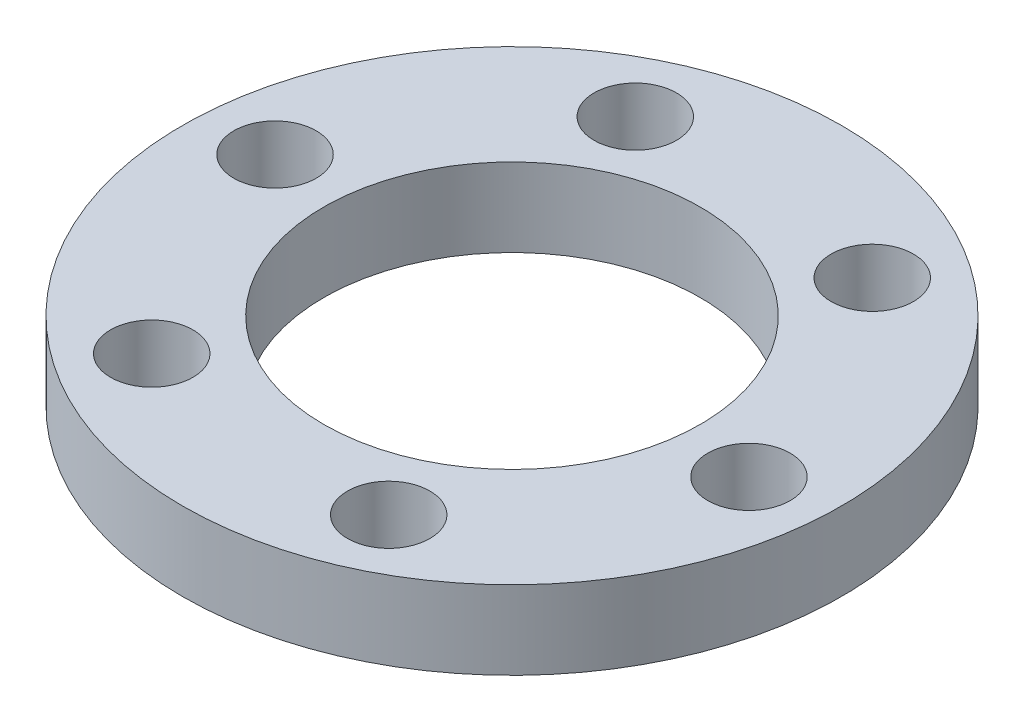
ISO-10303-21;
HEADER;
FILE_DESCRIPTION(('STEP AP214'),'2;1');
FILE_NAME('part.step','',(''),(''),'','','');
FILE_SCHEMA(('AUTOMOTIVE_DESIGN { 1 0 10303 214 1 1 1 1 }'));
ENDSEC;
DATA;
#1=APPLICATION_CONTEXT('core data for automotive mechanical design processes');
#2=APPLICATION_PROTOCOL_DEFINITION('international standard','automotive_design',2000,#1);
#3=PRODUCT_CONTEXT('',#1,'mechanical');
#4=PRODUCT('Part','Part','',(#3));
#5=PRODUCT_RELATED_PRODUCT_CATEGORY('part','',(#4));
#6=PRODUCT_DEFINITION_FORMATION('','',#4);
#7=PRODUCT_DEFINITION_CONTEXT('part definition',#1,'design');
#8=PRODUCT_DEFINITION('design','',#6,#7);
#9=PRODUCT_DEFINITION_SHAPE('','',#8);
#10=(LENGTH_UNIT() NAMED_UNIT(*) SI_UNIT(.MILLI.,.METRE.));
#11=(NAMED_UNIT(*) PLANE_ANGLE_UNIT() SI_UNIT($,.RADIAN.));
#12=(NAMED_UNIT(*) SI_UNIT($,.STERADIAN.) SOLID_ANGLE_UNIT());
#13=UNCERTAINTY_MEASURE_WITH_UNIT(LENGTH_MEASURE(1.E-05),#10,'distance_accuracy_value','');
#14=(GEOMETRIC_REPRESENTATION_CONTEXT(3) GLOBAL_UNCERTAINTY_ASSIGNED_CONTEXT((#13)) GLOBAL_UNIT_ASSIGNED_CONTEXT((#10,
#11,#12)) REPRESENTATION_CONTEXT('',''));
#15=CARTESIAN_POINT('',(0.,0.,0.));
#16=DIRECTION('',(0.,0.,1.));
#17=DIRECTION('',(1.,0.,0.));
#18=AXIS2_PLACEMENT_3D('',#15,#16,#17);
#19=CARTESIAN_POINT('',(0.,5.,0.));
#20=DIRECTION('',(0.,1.,0.));
#21=DIRECTION('',(0.,0.,1.));
#22=AXIS2_PLACEMENT_3D('',#19,#20,#21);
#23=PLANE('',#22);
#24=CARTESIAN_POINT('',(7.05789789959426,5.,14.9142910404376));
#25=DIRECTION('',(0.,1.,0.));
#26=DIRECTION('',(0.,0.,1.));
#27=AXIS2_PLACEMENT_3D('',#24,#25,#26);
#28=CIRCLE('',#27,2.62499999999985);
#29=CARTESIAN_POINT('',(7.05789789959426,5.,17.5392910404374));
#30=VERTEX_POINT('',#29);
#31=EDGE_CURVE('E88',#30,#30,#28,.T.);
#32=ORIENTED_EDGE('',*,*,#31,.F.);
#33=EDGE_LOOP('',(#32));
#34=FACE_BOUND('',#33,.T.);
#35=CARTESIAN_POINT('',(9.38720597065741,5.,-13.5694643985856));
#36=DIRECTION('',(0.,1.,0.));
#37=DIRECTION('',(0.,0.,1.));
#38=AXIS2_PLACEMENT_3D('',#35,#36,#37);
#39=CIRCLE('',#38,2.6250000000013);
#40=CARTESIAN_POINT('',(9.38720597065741,5.,-10.9444643985843));
#41=VERTEX_POINT('',#40);
#42=EDGE_CURVE('E72',#41,#41,#39,.T.);
#43=ORIENTED_EDGE('',*,*,#42,.F.);
#44=EDGE_LOOP('',(#43));
#45=FACE_BOUND('',#44,.T.);
#46=CARTESIAN_POINT('',(-16.4451038702514,5.,-1.34482664185481));
#47=DIRECTION('',(0.,1.,0.));
#48=DIRECTION('',(0.,0.,1.));
#49=AXIS2_PLACEMENT_3D('',#46,#47,#48);
#50=CIRCLE('',#49,2.625);
#51=CARTESIAN_POINT('',(-16.4451038702514,5.,1.28017335814519));
#52=VERTEX_POINT('',#51);
#53=EDGE_CURVE('E56',#52,#52,#50,.T.);
#54=ORIENTED_EDGE('',*,*,#53,.F.);
#55=EDGE_LOOP('',(#54));
#56=FACE_BOUND('',#55,.T.);
#57=CARTESIAN_POINT('',(0.,5.,0.));
#58=DIRECTION('',(0.,1.,0.));
#59=DIRECTION('',(0.,0.,1.));
#60=AXIS2_PLACEMENT_3D('',#57,#58,#59);
#61=CIRCLE('',#60,21.);
#62=CARTESIAN_POINT('',(0.,5.,21.));
#63=VERTEX_POINT('',#62);
#64=EDGE_CURVE('E10',#63,#63,#61,.T.);
#65=ORIENTED_EDGE('',*,*,#64,.T.);
#66=EDGE_LOOP('',(#65));
#67=FACE_BOUND('',#66,.T.);
#68=CARTESIAN_POINT('',(0.,5.,0.));
#69=DIRECTION('',(0.,1.,0.));
#70=DIRECTION('',(0.,0.,1.));
#71=AXIS2_PLACEMENT_3D('',#68,#69,#70);
#72=CIRCLE('',#71,12.);
#73=CARTESIAN_POINT('',(0.,5.,12.));
#74=VERTEX_POINT('',#73);
#75=EDGE_CURVE('E50',#74,#74,#72,.T.);
#76=ORIENTED_EDGE('',*,*,#75,.F.);
#77=EDGE_LOOP('',(#76));
#78=FACE_BOUND('',#77,.T.);
#79=CARTESIAN_POINT('',(-7.05789789959408,5.,-14.9142910404394));
#80=DIRECTION('',(0.,1.,0.));
#81=DIRECTION('',(0.,0.,1.));
#82=AXIS2_PLACEMENT_3D('',#79,#80,#81);
#83=CIRCLE('',#82,2.62500000000094);
#84=CARTESIAN_POINT('',(-7.05789789959408,5.,-12.2892910404385));
#85=VERTEX_POINT('',#84);
#86=EDGE_CURVE('E64',#85,#85,#83,.T.);
#87=ORIENTED_EDGE('',*,*,#86,.F.);
#88=EDGE_LOOP('',(#87));
#89=FACE_BOUND('',#88,.T.);
#90=CARTESIAN_POINT('',(16.4451038702516,5.,1.34482664185296));
#91=DIRECTION('',(0.,1.,0.));
#92=DIRECTION('',(0.,0.,1.));
#93=AXIS2_PLACEMENT_3D('',#90,#91,#92);
#94=CIRCLE('',#93,2.62500000000074);
#95=CARTESIAN_POINT('',(16.4451038702516,5.,3.9698266418537));
#96=VERTEX_POINT('',#95);
#97=EDGE_CURVE('E80',#96,#96,#94,.T.);
#98=ORIENTED_EDGE('',*,*,#97,.F.);
#99=EDGE_LOOP('',(#98));
#100=FACE_BOUND('',#99,.T.);
#101=CARTESIAN_POINT('',(-9.38720597065723,5.,13.5694643985837));
#102=DIRECTION('',(0.,1.,0.));
#103=DIRECTION('',(0.,0.,1.));
#104=AXIS2_PLACEMENT_3D('',#101,#102,#103);
#105=CIRCLE('',#104,2.62499999999951);
#106=CARTESIAN_POINT('',(-9.38720597065723,5.,16.1944643985832));
#107=VERTEX_POINT('',#106);
#108=EDGE_CURVE('E96',#107,#107,#105,.T.);
#109=ORIENTED_EDGE('',*,*,#108,.F.);
#110=EDGE_LOOP('',(#109));
#111=FACE_BOUND('',#110,.T.);
#112=ADVANCED_FACE('F37',(#34,#45,#56,#67,#78,#89,#100,#111),#23,.T.);
#113=CARTESIAN_POINT('',(0.,0.,0.));
#114=DIRECTION('',(0.,1.,0.));
#115=DIRECTION('',(0.,0.,1.));
#116=AXIS2_PLACEMENT_3D('',#113,#114,#115);
#117=PLANE('',#116);
#118=CARTESIAN_POINT('',(0.,0.,0.));
#119=DIRECTION('',(0.,1.,0.));
#120=DIRECTION('',(0.,0.,1.));
#121=AXIS2_PLACEMENT_3D('',#118,#119,#120);
#122=CIRCLE('',#121,21.);
#123=CARTESIAN_POINT('',(0.,0.,21.));
#124=VERTEX_POINT('',#123);
#125=EDGE_CURVE('E41',#124,#124,#122,.T.);
#126=ORIENTED_EDGE('',*,*,#125,.F.);
#127=EDGE_LOOP('',(#126));
#128=FACE_BOUND('',#127,.T.);
#129=CARTESIAN_POINT('',(0.,0.,0.));
#130=DIRECTION('',(0.,1.,0.));
#131=DIRECTION('',(0.,0.,1.));
#132=AXIS2_PLACEMENT_3D('',#129,#130,#131);
#133=CIRCLE('',#132,12.);
#134=CARTESIAN_POINT('',(0.,0.,12.));
#135=VERTEX_POINT('',#134);
#136=EDGE_CURVE('E52',#135,#135,#133,.T.);
#137=ORIENTED_EDGE('',*,*,#136,.T.);
#138=EDGE_LOOP('',(#137));
#139=FACE_BOUND('',#138,.T.);
#140=CARTESIAN_POINT('',(-16.4451038702514,0.,-1.34482664185481));
#141=DIRECTION('',(0.,1.,0.));
#142=DIRECTION('',(0.,0.,1.));
#143=AXIS2_PLACEMENT_3D('',#140,#141,#142);
#144=CIRCLE('',#143,2.625);
#145=CARTESIAN_POINT('',(-16.4451038702514,0.,1.28017335814519));
#146=VERTEX_POINT('',#145);
#147=EDGE_CURVE('E60',#146,#146,#144,.T.);
#148=ORIENTED_EDGE('',*,*,#147,.T.);
#149=EDGE_LOOP('',(#148));
#150=FACE_BOUND('',#149,.T.);
#151=CARTESIAN_POINT('',(-7.05789789959408,0.,-14.9142910404394));
#152=DIRECTION('',(0.,1.,0.));
#153=DIRECTION('',(0.,0.,1.));
#154=AXIS2_PLACEMENT_3D('',#151,#152,#153);
#155=CIRCLE('',#154,2.62500000000094);
#156=CARTESIAN_POINT('',(-7.05789789959408,0.,-12.2892910404385));
#157=VERTEX_POINT('',#156);
#158=EDGE_CURVE('E68',#157,#157,#155,.T.);
#159=ORIENTED_EDGE('',*,*,#158,.T.);
#160=EDGE_LOOP('',(#159));
#161=FACE_BOUND('',#160,.T.);
#162=CARTESIAN_POINT('',(9.38720597065741,0.,-13.5694643985856));
#163=DIRECTION('',(0.,1.,0.));
#164=DIRECTION('',(0.,0.,1.));
#165=AXIS2_PLACEMENT_3D('',#162,#163,#164);
#166=CIRCLE('',#165,2.6250000000013);
#167=CARTESIAN_POINT('',(9.38720597065741,0.,-10.9444643985843));
#168=VERTEX_POINT('',#167);
#169=EDGE_CURVE('E76',#168,#168,#166,.T.);
#170=ORIENTED_EDGE('',*,*,#169,.T.);
#171=EDGE_LOOP('',(#170));
#172=FACE_BOUND('',#171,.T.);
#173=CARTESIAN_POINT('',(16.4451038702516,0.,1.34482664185296));
#174=DIRECTION('',(0.,1.,0.));
#175=DIRECTION('',(0.,0.,1.));
#176=AXIS2_PLACEMENT_3D('',#173,#174,#175);
#177=CIRCLE('',#176,2.62500000000074);
#178=CARTESIAN_POINT('',(16.4451038702516,0.,3.9698266418537));
#179=VERTEX_POINT('',#178);
#180=EDGE_CURVE('E84',#179,#179,#177,.T.);
#181=ORIENTED_EDGE('',*,*,#180,.T.);
#182=EDGE_LOOP('',(#181));
#183=FACE_BOUND('',#182,.T.);
#184=CARTESIAN_POINT('',(7.05789789959426,0.,14.9142910404376));
#185=DIRECTION('',(0.,1.,0.));
#186=DIRECTION('',(0.,0.,1.));
#187=AXIS2_PLACEMENT_3D('',#184,#185,#186);
#188=CIRCLE('',#187,2.62499999999985);
#189=CARTESIAN_POINT('',(7.05789789959426,0.,17.5392910404374));
#190=VERTEX_POINT('',#189);
#191=EDGE_CURVE('E92',#190,#190,#188,.T.);
#192=ORIENTED_EDGE('',*,*,#191,.T.);
#193=EDGE_LOOP('',(#192));
#194=FACE_BOUND('',#193,.T.);
#195=CARTESIAN_POINT('',(-9.38720597065723,0.,13.5694643985837));
#196=DIRECTION('',(0.,1.,0.));
#197=DIRECTION('',(0.,0.,1.));
#198=AXIS2_PLACEMENT_3D('',#195,#196,#197);
#199=CIRCLE('',#198,2.62499999999951);
#200=CARTESIAN_POINT('',(-9.38720597065723,0.,16.1944643985832));
#201=VERTEX_POINT('',#200);
#202=EDGE_CURVE('E100',#201,#201,#199,.T.);
#203=ORIENTED_EDGE('',*,*,#202,.T.);
#204=EDGE_LOOP('',(#203));
#205=FACE_BOUND('',#204,.T.);
#206=ADVANCED_FACE('F112',(#128,#139,#150,#161,#172,#183,#194,#205),#117,.F.);
#207=CARTESIAN_POINT('',(0.,5.,0.));
#208=DIRECTION('',(0.,-1.,0.));
#209=DIRECTION('',(0.,0.,-1.));
#210=AXIS2_PLACEMENT_3D('',#207,#208,#209);
#211=CYLINDRICAL_SURFACE('',#210,21.);
#212=ORIENTED_EDGE('',*,*,#64,.F.);
#213=EDGE_LOOP('',(#212));
#214=FACE_BOUND('',#213,.T.);
#215=ORIENTED_EDGE('',*,*,#125,.T.);
#216=EDGE_LOOP('',(#215));
#217=FACE_BOUND('',#216,.T.);
#218=ADVANCED_FACE('F39',(#214,#217),#211,.T.);
#219=CARTESIAN_POINT('',(0.,5.,0.));
#220=DIRECTION('',(0.,-1.,0.));
#221=DIRECTION('',(0.,0.,-1.));
#222=AXIS2_PLACEMENT_3D('',#219,#220,#221);
#223=CYLINDRICAL_SURFACE('',#222,12.);
#224=ORIENTED_EDGE('',*,*,#75,.T.);
#225=EDGE_LOOP('',(#224));
#226=FACE_BOUND('',#225,.T.);
#227=ORIENTED_EDGE('',*,*,#136,.F.);
#228=EDGE_LOOP('',(#227));
#229=FACE_BOUND('',#228,.T.);
#230=ADVANCED_FACE('F122',(#226,#229),#223,.F.);
#231=CARTESIAN_POINT('',(-16.4451038702514,5.,-1.34482664185481));
#232=DIRECTION('',(0.,-1.,0.));
#233=DIRECTION('',(0.,0.,-1.));
#234=AXIS2_PLACEMENT_3D('',#231,#232,#233);
#235=CYLINDRICAL_SURFACE('',#234,2.625);
#236=ORIENTED_EDGE('',*,*,#53,.T.);
#237=EDGE_LOOP('',(#236));
#238=FACE_BOUND('',#237,.T.);
#239=ORIENTED_EDGE('',*,*,#147,.F.);
#240=EDGE_LOOP('',(#239));
#241=FACE_BOUND('',#240,.T.);
#242=ADVANCED_FACE('F125',(#238,#241),#235,.F.);
#243=CARTESIAN_POINT('',(-7.05789789959408,5.,-14.9142910404394));
#244=DIRECTION('',(0.,-1.,0.));
#245=DIRECTION('',(0.,0.,-1.));
#246=AXIS2_PLACEMENT_3D('',#243,#244,#245);
#247=CYLINDRICAL_SURFACE('',#246,2.62500000000094);
#248=ORIENTED_EDGE('',*,*,#86,.T.);
#249=EDGE_LOOP('',(#248));
#250=FACE_BOUND('',#249,.T.);
#251=ORIENTED_EDGE('',*,*,#158,.F.);
#252=EDGE_LOOP('',(#251));
#253=FACE_BOUND('',#252,.T.);
#254=ADVANCED_FACE('F129',(#250,#253),#247,.F.);
#255=CARTESIAN_POINT('',(9.38720597065741,5.,-13.5694643985856));
#256=DIRECTION('',(0.,-1.,0.));
#257=DIRECTION('',(0.,0.,-1.));
#258=AXIS2_PLACEMENT_3D('',#255,#256,#257);
#259=CYLINDRICAL_SURFACE('',#258,2.6250000000013);
#260=ORIENTED_EDGE('',*,*,#42,.T.);
#261=EDGE_LOOP('',(#260));
#262=FACE_BOUND('',#261,.T.);
#263=ORIENTED_EDGE('',*,*,#169,.F.);
#264=EDGE_LOOP('',(#263));
#265=FACE_BOUND('',#264,.T.);
#266=ADVANCED_FACE('F133',(#262,#265),#259,.F.);
#267=CARTESIAN_POINT('',(16.4451038702516,5.,1.34482664185296));
#268=DIRECTION('',(0.,-1.,0.));
#269=DIRECTION('',(0.,0.,-1.));
#270=AXIS2_PLACEMENT_3D('',#267,#268,#269);
#271=CYLINDRICAL_SURFACE('',#270,2.62500000000074);
#272=ORIENTED_EDGE('',*,*,#97,.T.);
#273=EDGE_LOOP('',(#272));
#274=FACE_BOUND('',#273,.T.);
#275=ORIENTED_EDGE('',*,*,#180,.F.);
#276=EDGE_LOOP('',(#275));
#277=FACE_BOUND('',#276,.T.);
#278=ADVANCED_FACE('F137',(#274,#277),#271,.F.);
#279=CARTESIAN_POINT('',(7.05789789959426,5.,14.9142910404376));
#280=DIRECTION('',(0.,-1.,0.));
#281=DIRECTION('',(0.,0.,-1.));
#282=AXIS2_PLACEMENT_3D('',#279,#280,#281);
#283=CYLINDRICAL_SURFACE('',#282,2.62499999999985);
#284=ORIENTED_EDGE('',*,*,#31,.T.);
#285=EDGE_LOOP('',(#284));
#286=FACE_BOUND('',#285,.T.);
#287=ORIENTED_EDGE('',*,*,#191,.F.);
#288=EDGE_LOOP('',(#287));
#289=FACE_BOUND('',#288,.T.);
#290=ADVANCED_FACE('F141',(#286,#289),#283,.F.);
#291=CARTESIAN_POINT('',(-9.38720597065723,5.,13.5694643985837));
#292=DIRECTION('',(0.,-1.,0.));
#293=DIRECTION('',(0.,0.,-1.));
#294=AXIS2_PLACEMENT_3D('',#291,#292,#293);
#295=CYLINDRICAL_SURFACE('',#294,2.62499999999951);
#296=ORIENTED_EDGE('',*,*,#108,.T.);
#297=EDGE_LOOP('',(#296));
#298=FACE_BOUND('',#297,.T.);
#299=ORIENTED_EDGE('',*,*,#202,.F.);
#300=EDGE_LOOP('',(#299));
#301=FACE_BOUND('',#300,.T.);
#302=ADVANCED_FACE('F108',(#298,#301),#295,.F.);
#303=CLOSED_SHELL('',(#112,#206,#218,#230,#242,#254,#266,#278,#290,#302));
#304=MANIFOLD_SOLID_BREP('B2',#303);
#305=ADVANCED_BREP_SHAPE_REPRESENTATION('',(#18,#304),#14);
#306=SHAPE_DEFINITION_REPRESENTATION(#9,#305);
ENDSEC;
END-ISO-10303-21;
